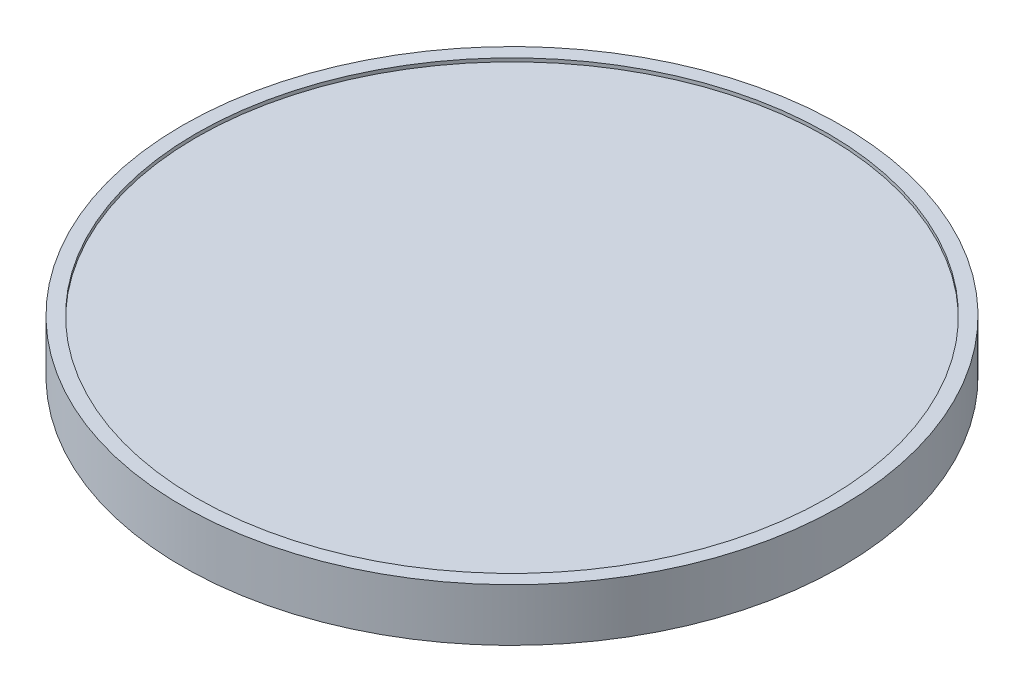
ISO-10303-21;
HEADER;
FILE_DESCRIPTION(('STEP AP214'),'2;1');
FILE_NAME('part.step','',(''),(''),'','','');
FILE_SCHEMA(('AUTOMOTIVE_DESIGN { 1 0 10303 214 1 1 1 1 }'));
ENDSEC;
DATA;
#1=APPLICATION_CONTEXT('core data for automotive mechanical design processes');
#2=APPLICATION_PROTOCOL_DEFINITION('international standard','automotive_design',2000,#1);
#3=PRODUCT_CONTEXT('',#1,'mechanical');
#4=PRODUCT('Part','Part','',(#3));
#5=PRODUCT_RELATED_PRODUCT_CATEGORY('part','',(#4));
#6=PRODUCT_DEFINITION_FORMATION('','',#4);
#7=PRODUCT_DEFINITION_CONTEXT('part definition',#1,'design');
#8=PRODUCT_DEFINITION('design','',#6,#7);
#9=PRODUCT_DEFINITION_SHAPE('','',#8);
#10=(LENGTH_UNIT() NAMED_UNIT(*) SI_UNIT(.MILLI.,.METRE.));
#11=(NAMED_UNIT(*) PLANE_ANGLE_UNIT() SI_UNIT($,.RADIAN.));
#12=(NAMED_UNIT(*) SI_UNIT($,.STERADIAN.) SOLID_ANGLE_UNIT());
#13=UNCERTAINTY_MEASURE_WITH_UNIT(LENGTH_MEASURE(1.E-05),#10,'distance_accuracy_value','');
#14=(GEOMETRIC_REPRESENTATION_CONTEXT(3) GLOBAL_UNCERTAINTY_ASSIGNED_CONTEXT((#13)) GLOBAL_UNIT_ASSIGNED_CONTEXT((#10,
#11,#12)) REPRESENTATION_CONTEXT('',''));
#15=CARTESIAN_POINT('',(0.,0.,0.));
#16=DIRECTION('',(0.,0.,1.));
#17=DIRECTION('',(1.,0.,0.));
#18=AXIS2_PLACEMENT_3D('',#15,#16,#17);
#19=CARTESIAN_POINT('',(0.,0.66,0.));
#20=DIRECTION('',(0.,-1.,0.));
#21=DIRECTION('',(1.,0.,0.));
#22=AXIS2_PLACEMENT_3D('',#19,#20,#21);
#23=PLANE('',#22);
#24=CARTESIAN_POINT('',(0.,0.66,0.));
#25=DIRECTION('',(0.,1.,0.));
#26=DIRECTION('',(-1.,0.,0.));
#27=AXIS2_PLACEMENT_3D('',#24,#25,#26);
#28=CIRCLE('',#27,9.125);
#29=CARTESIAN_POINT('',(-9.125,0.66,0.));
#30=VERTEX_POINT('',#29);
#31=EDGE_CURVE('E10',#30,#30,#28,.T.);
#32=ORIENTED_EDGE('',*,*,#31,.T.);
#33=EDGE_LOOP('',(#32));
#34=FACE_BOUND('',#33,.T.);
#35=ADVANCED_FACE('F45',(#34),#23,.F.);
#36=CARTESIAN_POINT('',(0.,5.731966580274,0.));
#37=DIRECTION('',(0.,1.,0.));
#38=DIRECTION('',(-1.,0.,0.));
#39=AXIS2_PLACEMENT_3D('',#36,#37,#38);
#40=CYLINDRICAL_SURFACE('',#39,9.125);
#41=ORIENTED_EDGE('',*,*,#31,.F.);
#42=EDGE_LOOP('',(#41));
#43=FACE_BOUND('',#42,.T.);
#44=CARTESIAN_POINT('',(0.,0.759999999999999,0.));
#45=DIRECTION('',(0.,1.,0.));
#46=DIRECTION('',(-1.,0.,0.));
#47=AXIS2_PLACEMENT_3D('',#44,#45,#46);
#48=CIRCLE('',#47,9.125);
#49=CARTESIAN_POINT('',(-9.125,0.759999999999999,0.));
#50=VERTEX_POINT('',#49);
#51=EDGE_CURVE('E52',#50,#50,#48,.T.);
#52=ORIENTED_EDGE('',*,*,#51,.T.);
#53=EDGE_LOOP('',(#52));
#54=FACE_BOUND('',#53,.T.);
#55=ADVANCED_FACE('F89',(#43,#54),#40,.F.);
#56=CARTESIAN_POINT('',(9.125,0.76,0.));
#57=DIRECTION('',(0.,-1.,0.));
#58=DIRECTION('',(1.,0.,0.));
#59=AXIS2_PLACEMENT_3D('',#56,#57,#58);
#60=PLANE('',#59);
#61=ORIENTED_EDGE('',*,*,#51,.F.);
#62=EDGE_LOOP('',(#61));
#63=FACE_BOUND('',#62,.T.);
#64=CARTESIAN_POINT('',(0.,0.76,0.));
#65=DIRECTION('',(0.,1.,0.));
#66=DIRECTION('',(-1.,0.,0.));
#67=AXIS2_PLACEMENT_3D('',#64,#65,#66);
#68=CIRCLE('',#67,9.525);
#69=CARTESIAN_POINT('',(-9.525,0.76,0.));
#70=VERTEX_POINT('',#69);
#71=EDGE_CURVE('E57',#70,#70,#68,.T.);
#72=ORIENTED_EDGE('',*,*,#71,.T.);
#73=EDGE_LOOP('',(#72));
#74=FACE_BOUND('',#73,.T.);
#75=ADVANCED_FACE('F93',(#63,#74),#60,.F.);
#76=CARTESIAN_POINT('',(0.,5.731966580274,0.));
#77=DIRECTION('',(0.,1.,0.));
#78=DIRECTION('',(-1.,0.,0.));
#79=AXIS2_PLACEMENT_3D('',#76,#77,#78);
#80=CYLINDRICAL_SURFACE('',#79,9.525);
#81=ORIENTED_EDGE('',*,*,#71,.F.);
#82=EDGE_LOOP('',(#81));
#83=FACE_BOUND('',#82,.T.);
#84=CARTESIAN_POINT('',(0.,-0.76,0.));
#85=DIRECTION('',(0.,1.,0.));
#86=DIRECTION('',(-1.,0.,0.));
#87=AXIS2_PLACEMENT_3D('',#84,#85,#86);
#88=CIRCLE('',#87,9.525);
#89=CARTESIAN_POINT('',(-9.525,-0.76,0.));
#90=VERTEX_POINT('',#89);
#91=EDGE_CURVE('E62',#90,#90,#88,.T.);
#92=ORIENTED_EDGE('',*,*,#91,.T.);
#93=EDGE_LOOP('',(#92));
#94=FACE_BOUND('',#93,.T.);
#95=ADVANCED_FACE('F98',(#83,#94),#80,.T.);
#96=CARTESIAN_POINT('',(9.525,-0.76,0.));
#97=DIRECTION('',(0.,1.,0.));
#98=DIRECTION('',(-1.,0.,0.));
#99=AXIS2_PLACEMENT_3D('',#96,#97,#98);
#100=PLANE('',#99);
#101=ORIENTED_EDGE('',*,*,#91,.F.);
#102=EDGE_LOOP('',(#101));
#103=FACE_BOUND('',#102,.T.);
#104=CARTESIAN_POINT('',(0.,-0.76,0.));
#105=DIRECTION('',(0.,1.,0.));
#106=DIRECTION('',(-1.,0.,0.));
#107=AXIS2_PLACEMENT_3D('',#104,#105,#106);
#108=CIRCLE('',#107,9.125);
#109=CARTESIAN_POINT('',(-9.125,-0.76,0.));
#110=VERTEX_POINT('',#109);
#111=EDGE_CURVE('E68',#110,#110,#108,.T.);
#112=ORIENTED_EDGE('',*,*,#111,.T.);
#113=EDGE_LOOP('',(#112));
#114=FACE_BOUND('',#113,.T.);
#115=ADVANCED_FACE('F85',(#103,#114),#100,.F.);
#116=CARTESIAN_POINT('',(0.,5.731966580274,0.));
#117=DIRECTION('',(0.,1.,0.));
#118=DIRECTION('',(-1.,0.,0.));
#119=AXIS2_PLACEMENT_3D('',#116,#117,#118);
#120=CYLINDRICAL_SURFACE('',#119,9.125);
#121=ORIENTED_EDGE('',*,*,#111,.F.);
#122=EDGE_LOOP('',(#121));
#123=FACE_BOUND('',#122,.T.);
#124=CARTESIAN_POINT('',(0.,-0.659999999999996,0.));
#125=DIRECTION('',(0.,1.,0.));
#126=DIRECTION('',(-1.,0.,0.));
#127=AXIS2_PLACEMENT_3D('',#124,#125,#126);
#128=CIRCLE('',#127,9.125);
#129=CARTESIAN_POINT('',(-9.125,-0.659999999999997,0.));
#130=VERTEX_POINT('',#129);
#131=EDGE_CURVE('E72',#130,#130,#128,.T.);
#132=ORIENTED_EDGE('',*,*,#131,.T.);
#133=EDGE_LOOP('',(#132));
#134=FACE_BOUND('',#133,.T.);
#135=ADVANCED_FACE('F77',(#123,#134),#120,.F.);
#136=CARTESIAN_POINT('',(9.125,-0.659999999999998,0.));
#137=DIRECTION('',(0.,1.,0.));
#138=DIRECTION('',(-1.,0.,0.));
#139=AXIS2_PLACEMENT_3D('',#136,#137,#138);
#140=PLANE('',#139);
#141=ORIENTED_EDGE('',*,*,#131,.F.);
#142=EDGE_LOOP('',(#141));
#143=FACE_BOUND('',#142,.T.);
#144=ADVANCED_FACE('F79',(#143),#140,.F.);
#145=CLOSED_SHELL('',(#35,#55,#75,#95,#115,#135,#144));
#146=MANIFOLD_SOLID_BREP('B2',#145);
#147=ADVANCED_BREP_SHAPE_REPRESENTATION('',(#18,#146),#14);
#148=SHAPE_DEFINITION_REPRESENTATION(#9,#147);
ENDSEC;
END-ISO-10303-21;
